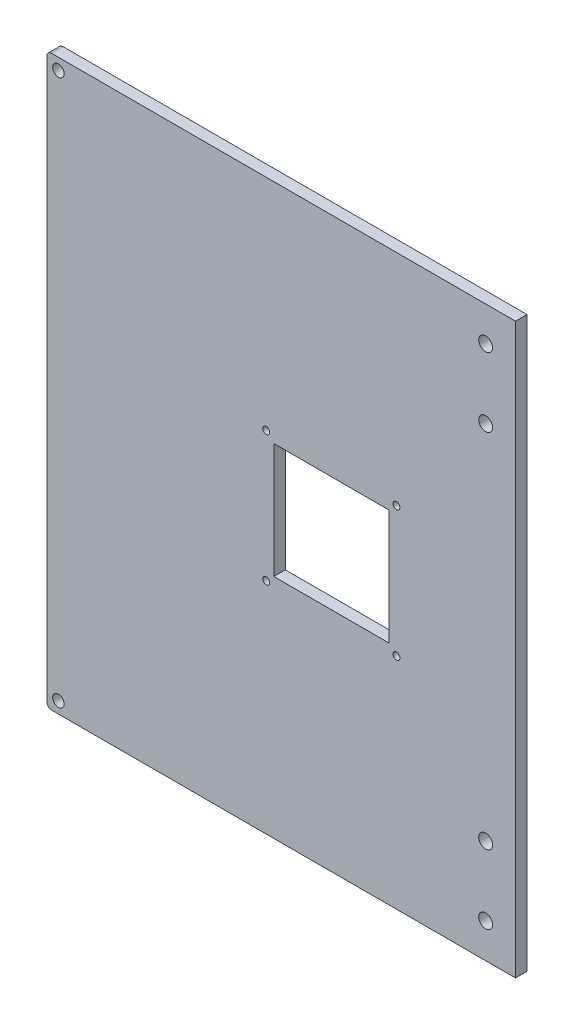
ISO-10303-21;
HEADER;
FILE_DESCRIPTION(('STEP AP214'),'2;1');
FILE_NAME('part.step','',(''),(''),'','','');
FILE_SCHEMA(('AUTOMOTIVE_DESIGN { 1 0 10303 214 1 1 1 1 }'));
ENDSEC;
DATA;
#1=APPLICATION_CONTEXT('core data for automotive mechanical design processes');
#2=APPLICATION_PROTOCOL_DEFINITION('international standard','automotive_design',2000,#1);
#3=PRODUCT_CONTEXT('',#1,'mechanical');
#4=PRODUCT('Part','Part','',(#3));
#5=PRODUCT_RELATED_PRODUCT_CATEGORY('part','',(#4));
#6=PRODUCT_DEFINITION_FORMATION('','',#4);
#7=PRODUCT_DEFINITION_CONTEXT('part definition',#1,'design');
#8=PRODUCT_DEFINITION('design','',#6,#7);
#9=PRODUCT_DEFINITION_SHAPE('','',#8);
#10=(LENGTH_UNIT() NAMED_UNIT(*) SI_UNIT(.MILLI.,.METRE.));
#11=(NAMED_UNIT(*) PLANE_ANGLE_UNIT() SI_UNIT($,.RADIAN.));
#12=(NAMED_UNIT(*) SI_UNIT($,.STERADIAN.) SOLID_ANGLE_UNIT());
#13=UNCERTAINTY_MEASURE_WITH_UNIT(LENGTH_MEASURE(1.E-05),#10,'distance_accuracy_value','');
#14=(GEOMETRIC_REPRESENTATION_CONTEXT(3) GLOBAL_UNCERTAINTY_ASSIGNED_CONTEXT((#13)) GLOBAL_UNIT_ASSIGNED_CONTEXT((#10,
#11,#12)) REPRESENTATION_CONTEXT('',''));
#15=CARTESIAN_POINT('',(0.,0.,0.));
#16=DIRECTION('',(0.,0.,1.));
#17=DIRECTION('',(1.,0.,0.));
#18=AXIS2_PLACEMENT_3D('',#15,#16,#17);
#19=CARTESIAN_POINT('',(-121.5,-121.5,5.));
#20=DIRECTION('',(0.,0.,1.));
#21=DIRECTION('',(1.,0.,0.));
#22=AXIS2_PLACEMENT_3D('',#19,#20,#21);
#23=PLANE('',#22);
#24=CARTESIAN_POINT('',(67.,108.5,5.));
#25=DIRECTION('',(0.,0.,1.));
#26=DIRECTION('',(1.,0.,0.));
#27=AXIS2_PLACEMENT_3D('',#24,#25,#26);
#28=CIRCLE('',#27,3.00000000000001);
#29=CARTESIAN_POINT('',(70.,108.5,5.));
#30=VERTEX_POINT('',#29);
#31=EDGE_CURVE('E127',#30,#30,#28,.T.);
#32=ORIENTED_EDGE('',*,*,#31,.F.);
#33=EDGE_LOOP('',(#32));
#34=FACE_BOUND('',#33,.T.);
#35=CARTESIAN_POINT('',(67.,-78.5,5.));
#36=DIRECTION('',(0.,0.,1.));
#37=DIRECTION('',(1.,0.,0.));
#38=AXIS2_PLACEMENT_3D('',#35,#36,#37);
#39=CIRCLE('',#38,3.00000000000001);
#40=CARTESIAN_POINT('',(70.,-78.5,5.));
#41=VERTEX_POINT('',#40);
#42=EDGE_CURVE('E282',#41,#41,#39,.T.);
#43=ORIENTED_EDGE('',*,*,#42,.F.);
#44=EDGE_LOOP('',(#43));
#45=FACE_BOUND('',#44,.T.);
#46=CARTESIAN_POINT('',(67.,-108.5,5.));
#47=DIRECTION('',(0.,0.,1.));
#48=DIRECTION('',(1.,0.,0.));
#49=AXIS2_PLACEMENT_3D('',#46,#47,#48);
#50=CIRCLE('',#49,3.00000000000001);
#51=CARTESIAN_POINT('',(70.,-108.5,5.));
#52=VERTEX_POINT('',#51);
#53=EDGE_CURVE('E285',#52,#52,#50,.T.);
#54=ORIENTED_EDGE('',*,*,#53,.F.);
#55=EDGE_LOOP('',(#54));
#56=FACE_BOUND('',#55,.T.);
#57=CARTESIAN_POINT('',(67.,78.5,5.));
#58=DIRECTION('',(0.,0.,1.));
#59=DIRECTION('',(1.,0.,0.));
#60=AXIS2_PLACEMENT_3D('',#57,#58,#59);
#61=CIRCLE('',#60,3.00000000000001);
#62=CARTESIAN_POINT('',(70.,78.5,5.));
#63=VERTEX_POINT('',#62);
#64=EDGE_CURVE('E288',#63,#63,#61,.T.);
#65=ORIENTED_EDGE('',*,*,#64,.F.);
#66=EDGE_LOOP('',(#65));
#67=FACE_BOUND('',#66,.T.);
#68=DIRECTION('',(0.,-1.,0.));
#69=VECTOR('',#68,1.);
#70=CARTESIAN_POINT('',(80.,-121.5,5.));
#71=LINE('',#70,#69);
#72=CARTESIAN_POINT('',(80.,123.5,5.));
#73=VERTEX_POINT('',#72);
#74=CARTESIAN_POINT('',(80.,-123.5,5.));
#75=VERTEX_POINT('',#74);
#76=EDGE_CURVE('E112',#73,#75,#71,.T.);
#77=ORIENTED_EDGE('',*,*,#76,.F.);
#78=DIRECTION('',(-1.,0.,0.));
#79=VECTOR('',#78,1.);
#80=CARTESIAN_POINT('',(121.5,123.5,5.));
#81=LINE('',#80,#79);
#82=CARTESIAN_POINT('',(-121.5,123.5,5.));
#83=VERTEX_POINT('',#82);
#84=EDGE_CURVE('E172',#73,#83,#81,.T.);
#85=ORIENTED_EDGE('',*,*,#84,.T.);
#86=CARTESIAN_POINT('',(-121.5,121.5,5.));
#87=DIRECTION('',(0.,0.,1.));
#88=DIRECTION('',(-1.,0.,0.));
#89=AXIS2_PLACEMENT_3D('',#86,#87,#88);
#90=CIRCLE('',#89,2.);
#91=CARTESIAN_POINT('',(-123.5,121.5,5.));
#92=VERTEX_POINT('',#91);
#93=EDGE_CURVE('E158',#83,#92,#90,.T.);
#94=ORIENTED_EDGE('',*,*,#93,.T.);
#95=DIRECTION('',(0.,-1.,0.));
#96=VECTOR('',#95,1.);
#97=CARTESIAN_POINT('',(-123.5,121.5,5.));
#98=LINE('',#97,#96);
#99=CARTESIAN_POINT('',(-123.5,-121.5,5.));
#100=VERTEX_POINT('',#99);
#101=EDGE_CURVE('E148',#92,#100,#98,.T.);
#102=ORIENTED_EDGE('',*,*,#101,.T.);
#103=CARTESIAN_POINT('',(-121.5,-121.5,5.));
#104=DIRECTION('',(0.,0.,1.));
#105=DIRECTION('',(1.,0.,0.));
#106=AXIS2_PLACEMENT_3D('',#103,#104,#105);
#107=CIRCLE('',#106,2.);
#108=CARTESIAN_POINT('',(-121.5,-123.5,5.));
#109=VERTEX_POINT('',#108);
#110=EDGE_CURVE('E143',#100,#109,#107,.T.);
#111=ORIENTED_EDGE('',*,*,#110,.T.);
#112=DIRECTION('',(1.,0.,0.));
#113=VECTOR('',#112,1.);
#114=CARTESIAN_POINT('',(-121.5,-123.5,5.));
#115=LINE('',#114,#113);
#116=EDGE_CURVE('E170',#109,#75,#115,.T.);
#117=ORIENTED_EDGE('',*,*,#116,.T.);
#118=EDGE_LOOP('',(#77,#85,#94,#102,#111,#117));
#119=FACE_BOUND('',#118,.T.);
#120=CARTESIAN_POINT('',(28.2842712474618,28.284271247462,5.));
#121=DIRECTION('',(0.,0.,-1.));
#122=DIRECTION('',(1.,0.,0.));
#123=AXIS2_PLACEMENT_3D('',#120,#121,#122);
#124=CIRCLE('',#123,1.5);
#125=CARTESIAN_POINT('',(29.7842712474619,28.284271247462,5.));
#126=VERTEX_POINT('',#125);
#127=EDGE_CURVE('E259',#126,#126,#124,.T.);
#128=ORIENTED_EDGE('',*,*,#127,.T.);
#129=EDGE_LOOP('',(#128));
#130=FACE_BOUND('',#129,.T.);
#131=CARTESIAN_POINT('',(28.2842712474618,-28.284271247462,5.));
#132=DIRECTION('',(0.,0.,-1.));
#133=DIRECTION('',(-1.,0.,0.));
#134=AXIS2_PLACEMENT_3D('',#131,#132,#133);
#135=CIRCLE('',#134,1.5);
#136=CARTESIAN_POINT('',(26.7842712474618,-28.284271247462,5.));
#137=VERTEX_POINT('',#136);
#138=EDGE_CURVE('E265',#137,#137,#135,.T.);
#139=ORIENTED_EDGE('',*,*,#138,.T.);
#140=EDGE_LOOP('',(#139));
#141=FACE_BOUND('',#140,.T.);
#142=CARTESIAN_POINT('',(-28.2842712474618,-28.284271247462,5.));
#143=DIRECTION('',(0.,0.,-1.));
#144=DIRECTION('',(1.,0.,0.));
#145=AXIS2_PLACEMENT_3D('',#142,#143,#144);
#146=CIRCLE('',#145,1.5);
#147=CARTESIAN_POINT('',(-26.7842712474618,-28.284271247462,5.));
#148=VERTEX_POINT('',#147);
#149=EDGE_CURVE('E271',#148,#148,#146,.T.);
#150=ORIENTED_EDGE('',*,*,#149,.T.);
#151=EDGE_LOOP('',(#150));
#152=FACE_BOUND('',#151,.T.);
#153=CARTESIAN_POINT('',(-28.2842712474618,28.284271247462,5.));
#154=DIRECTION('',(0.,0.,-1.));
#155=DIRECTION('',(-1.,0.,0.));
#156=AXIS2_PLACEMENT_3D('',#153,#154,#155);
#157=CIRCLE('',#156,1.5);
#158=CARTESIAN_POINT('',(-29.7842712474619,28.284271247462,5.));
#159=VERTEX_POINT('',#158);
#160=EDGE_CURVE('E248',#159,#159,#157,.T.);
#161=ORIENTED_EDGE('',*,*,#160,.T.);
#162=EDGE_LOOP('',(#161));
#163=FACE_BOUND('',#162,.T.);
#164=DIRECTION('',(1.,0.,0.));
#165=VECTOR('',#164,1.);
#166=CARTESIAN_POINT('',(-25.,25.,5.));
#167=LINE('',#166,#165);
#168=CARTESIAN_POINT('',(-25.,25.,5.));
#169=VERTEX_POINT('',#168);
#170=CARTESIAN_POINT('',(25.,25.,5.));
#171=VERTEX_POINT('',#170);
#172=EDGE_CURVE('E239',#169,#171,#167,.T.);
#173=ORIENTED_EDGE('',*,*,#172,.T.);
#174=DIRECTION('',(0.,-1.,0.));
#175=VECTOR('',#174,1.);
#176=CARTESIAN_POINT('',(25.,25.,5.));
#177=LINE('',#176,#175);
#178=CARTESIAN_POINT('',(25.,-25.,5.));
#179=VERTEX_POINT('',#178);
#180=EDGE_CURVE('E252',#171,#179,#177,.T.);
#181=ORIENTED_EDGE('',*,*,#180,.T.);
#182=DIRECTION('',(-1.,0.,0.));
#183=VECTOR('',#182,1.);
#184=CARTESIAN_POINT('',(25.,-25.,5.));
#185=LINE('',#184,#183);
#186=CARTESIAN_POINT('',(-25.,-25.,5.));
#187=VERTEX_POINT('',#186);
#188=EDGE_CURVE('E57',#179,#187,#185,.T.);
#189=ORIENTED_EDGE('',*,*,#188,.T.);
#190=DIRECTION('',(0.,1.,0.));
#191=VECTOR('',#190,1.);
#192=CARTESIAN_POINT('',(-25.,-25.,5.));
#193=LINE('',#192,#191);
#194=EDGE_CURVE('E231',#187,#169,#193,.T.);
#195=ORIENTED_EDGE('',*,*,#194,.T.);
#196=EDGE_LOOP('',(#173,#181,#189,#195));
#197=FACE_BOUND('',#196,.T.);
#198=CARTESIAN_POINT('',(-118.5,118.5,5.));
#199=DIRECTION('',(0.,0.,1.));
#200=DIRECTION('',(1.,0.,0.));
#201=AXIS2_PLACEMENT_3D('',#198,#199,#200);
#202=CIRCLE('',#201,2.5);
#203=CARTESIAN_POINT('',(-116.,118.5,5.));
#204=VERTEX_POINT('',#203);
#205=EDGE_CURVE('E136',#204,#204,#202,.T.);
#206=ORIENTED_EDGE('',*,*,#205,.F.);
#207=EDGE_LOOP('',(#206));
#208=FACE_BOUND('',#207,.T.);
#209=CARTESIAN_POINT('',(-118.5,-118.5,5.));
#210=DIRECTION('',(0.,0.,1.));
#211=DIRECTION('',(-1.,0.,0.));
#212=AXIS2_PLACEMENT_3D('',#209,#210,#211);
#213=CIRCLE('',#212,2.5);
#214=CARTESIAN_POINT('',(-121.,-118.5,5.));
#215=VERTEX_POINT('',#214);
#216=EDGE_CURVE('E218',#215,#215,#213,.T.);
#217=ORIENTED_EDGE('',*,*,#216,.F.);
#218=EDGE_LOOP('',(#217));
#219=FACE_BOUND('',#218,.T.);
#220=ADVANCED_FACE('F35',(#34,#45,#56,#67,#119,#130,#141,#152,#163,#197,#208,#219),#23,.T.);
#221=CARTESIAN_POINT('',(-121.5,-121.5,0.));
#222=DIRECTION('',(0.,0.,1.));
#223=DIRECTION('',(1.,0.,0.));
#224=AXIS2_PLACEMENT_3D('',#221,#222,#223);
#225=PLANE('',#224);
#226=CARTESIAN_POINT('',(67.,108.5,0.));
#227=DIRECTION('',(0.,0.,-1.));
#228=DIRECTION('',(-1.,0.,0.));
#229=AXIS2_PLACEMENT_3D('',#226,#227,#228);
#230=CIRCLE('',#229,3.00000000000001);
#231=CARTESIAN_POINT('',(64.,108.5,0.));
#232=VERTEX_POINT('',#231);
#233=EDGE_CURVE('E291',#232,#232,#230,.T.);
#234=ORIENTED_EDGE('',*,*,#233,.F.);
#235=EDGE_LOOP('',(#234));
#236=FACE_BOUND('',#235,.T.);
#237=CARTESIAN_POINT('',(67.,-78.5,0.));
#238=DIRECTION('',(0.,0.,-1.));
#239=DIRECTION('',(1.,0.,0.));
#240=AXIS2_PLACEMENT_3D('',#237,#238,#239);
#241=CIRCLE('',#240,3.00000000000001);
#242=CARTESIAN_POINT('',(70.,-78.5,0.));
#243=VERTEX_POINT('',#242);
#244=EDGE_CURVE('E296',#243,#243,#241,.T.);
#245=ORIENTED_EDGE('',*,*,#244,.F.);
#246=EDGE_LOOP('',(#245));
#247=FACE_BOUND('',#246,.T.);
#248=CARTESIAN_POINT('',(67.,-108.5,0.));
#249=DIRECTION('',(0.,0.,-1.));
#250=DIRECTION('',(1.,0.,0.));
#251=AXIS2_PLACEMENT_3D('',#248,#249,#250);
#252=CIRCLE('',#251,3.00000000000001);
#253=CARTESIAN_POINT('',(70.,-108.5,0.));
#254=VERTEX_POINT('',#253);
#255=EDGE_CURVE('E292',#254,#254,#252,.T.);
#256=ORIENTED_EDGE('',*,*,#255,.F.);
#257=EDGE_LOOP('',(#256));
#258=FACE_BOUND('',#257,.T.);
#259=CARTESIAN_POINT('',(67.,78.5,0.));
#260=DIRECTION('',(0.,0.,-1.));
#261=DIRECTION('',(-1.,0.,0.));
#262=AXIS2_PLACEMENT_3D('',#259,#260,#261);
#263=CIRCLE('',#262,3.00000000000001);
#264=CARTESIAN_POINT('',(64.,78.5,0.));
#265=VERTEX_POINT('',#264);
#266=EDGE_CURVE('E295',#265,#265,#263,.T.);
#267=ORIENTED_EDGE('',*,*,#266,.F.);
#268=EDGE_LOOP('',(#267));
#269=FACE_BOUND('',#268,.T.);
#270=CARTESIAN_POINT('',(28.2842712474618,28.284271247462,0.));
#271=DIRECTION('',(0.,0.,-1.));
#272=DIRECTION('',(1.,0.,0.));
#273=AXIS2_PLACEMENT_3D('',#270,#271,#272);
#274=CIRCLE('',#273,1.5);
#275=CARTESIAN_POINT('',(29.7842712474619,28.284271247462,0.));
#276=VERTEX_POINT('',#275);
#277=EDGE_CURVE('E116',#276,#276,#274,.T.);
#278=ORIENTED_EDGE('',*,*,#277,.F.);
#279=EDGE_LOOP('',(#278));
#280=FACE_BOUND('',#279,.T.);
#281=CARTESIAN_POINT('',(28.2842712474618,-28.284271247462,0.));
#282=DIRECTION('',(0.,0.,-1.));
#283=DIRECTION('',(-1.,0.,0.));
#284=AXIS2_PLACEMENT_3D('',#281,#282,#283);
#285=CIRCLE('',#284,1.5);
#286=CARTESIAN_POINT('',(26.7842712474618,-28.284271247462,0.));
#287=VERTEX_POINT('',#286);
#288=EDGE_CURVE('E262',#287,#287,#285,.T.);
#289=ORIENTED_EDGE('',*,*,#288,.F.);
#290=EDGE_LOOP('',(#289));
#291=FACE_BOUND('',#290,.T.);
#292=CARTESIAN_POINT('',(-28.2842712474618,-28.284271247462,0.));
#293=DIRECTION('',(0.,0.,-1.));
#294=DIRECTION('',(1.,0.,0.));
#295=AXIS2_PLACEMENT_3D('',#292,#293,#294);
#296=CIRCLE('',#295,1.5);
#297=CARTESIAN_POINT('',(-26.7842712474618,-28.284271247462,0.));
#298=VERTEX_POINT('',#297);
#299=EDGE_CURVE('E268',#298,#298,#296,.T.);
#300=ORIENTED_EDGE('',*,*,#299,.F.);
#301=EDGE_LOOP('',(#300));
#302=FACE_BOUND('',#301,.T.);
#303=CARTESIAN_POINT('',(-28.2842712474618,28.284271247462,0.));
#304=DIRECTION('',(0.,0.,-1.));
#305=DIRECTION('',(-1.,0.,0.));
#306=AXIS2_PLACEMENT_3D('',#303,#304,#305);
#307=CIRCLE('',#306,1.5);
#308=CARTESIAN_POINT('',(-29.7842712474619,28.284271247462,0.));
#309=VERTEX_POINT('',#308);
#310=EDGE_CURVE('E274',#309,#309,#307,.T.);
#311=ORIENTED_EDGE('',*,*,#310,.F.);
#312=EDGE_LOOP('',(#311));
#313=FACE_BOUND('',#312,.T.);
#314=DIRECTION('',(0.,-1.,0.));
#315=VECTOR('',#314,1.);
#316=CARTESIAN_POINT('',(25.,25.,0.));
#317=LINE('',#316,#315);
#318=CARTESIAN_POINT('',(25.,25.,0.));
#319=VERTEX_POINT('',#318);
#320=CARTESIAN_POINT('',(25.,-25.,0.));
#321=VERTEX_POINT('',#320);
#322=EDGE_CURVE('E243',#319,#321,#317,.T.);
#323=ORIENTED_EDGE('',*,*,#322,.F.);
#324=DIRECTION('',(1.,0.,0.));
#325=VECTOR('',#324,1.);
#326=CARTESIAN_POINT('',(-25.,25.,0.));
#327=LINE('',#326,#325);
#328=CARTESIAN_POINT('',(-25.,25.,0.));
#329=VERTEX_POINT('',#328);
#330=EDGE_CURVE('E246',#329,#319,#327,.T.);
#331=ORIENTED_EDGE('',*,*,#330,.F.);
#332=DIRECTION('',(0.,1.,0.));
#333=VECTOR('',#332,1.);
#334=CARTESIAN_POINT('',(-25.,-25.,0.));
#335=LINE('',#334,#333);
#336=CARTESIAN_POINT('',(-25.,-25.,0.));
#337=VERTEX_POINT('',#336);
#338=EDGE_CURVE('E236',#337,#329,#335,.T.);
#339=ORIENTED_EDGE('',*,*,#338,.F.);
#340=DIRECTION('',(-1.,0.,0.));
#341=VECTOR('',#340,1.);
#342=CARTESIAN_POINT('',(25.,-25.,0.));
#343=LINE('',#342,#341);
#344=EDGE_CURVE('E240',#321,#337,#343,.T.);
#345=ORIENTED_EDGE('',*,*,#344,.F.);
#346=EDGE_LOOP('',(#323,#331,#339,#345));
#347=FACE_BOUND('',#346,.T.);
#348=DIRECTION('',(-1.,0.,0.));
#349=VECTOR('',#348,1.);
#350=CARTESIAN_POINT('',(121.5,123.5,0.));
#351=LINE('',#350,#349);
#352=CARTESIAN_POINT('',(80.,123.5,0.));
#353=VERTEX_POINT('',#352);
#354=CARTESIAN_POINT('',(-121.5,123.5,0.));
#355=VERTEX_POINT('',#354);
#356=EDGE_CURVE('E126',#353,#355,#351,.T.);
#357=ORIENTED_EDGE('',*,*,#356,.F.);
#358=DIRECTION('',(0.,1.,0.));
#359=VECTOR('',#358,1.);
#360=CARTESIAN_POINT('',(80.,-150.,0.));
#361=LINE('',#360,#359);
#362=CARTESIAN_POINT('',(80.,-123.5,0.));
#363=VERTEX_POINT('',#362);
#364=EDGE_CURVE('E50',#363,#353,#361,.T.);
#365=ORIENTED_EDGE('',*,*,#364,.F.);
#366=DIRECTION('',(1.,0.,0.));
#367=VECTOR('',#366,1.);
#368=CARTESIAN_POINT('',(-121.5,-123.5,0.));
#369=LINE('',#368,#367);
#370=CARTESIAN_POINT('',(-121.5,-123.5,0.));
#371=VERTEX_POINT('',#370);
#372=EDGE_CURVE('E123',#371,#363,#369,.T.);
#373=ORIENTED_EDGE('',*,*,#372,.F.);
#374=CARTESIAN_POINT('',(-121.5,-121.5,0.));
#375=DIRECTION('',(0.,0.,1.));
#376=DIRECTION('',(1.,0.,0.));
#377=AXIS2_PLACEMENT_3D('',#374,#375,#376);
#378=CIRCLE('',#377,2.);
#379=CARTESIAN_POINT('',(-123.5,-121.5,0.));
#380=VERTEX_POINT('',#379);
#381=EDGE_CURVE('E132',#380,#371,#378,.T.);
#382=ORIENTED_EDGE('',*,*,#381,.F.);
#383=DIRECTION('',(0.,-1.,0.));
#384=VECTOR('',#383,1.);
#385=CARTESIAN_POINT('',(-123.5,121.5,0.));
#386=LINE('',#385,#384);
#387=CARTESIAN_POINT('',(-123.5,121.5,0.));
#388=VERTEX_POINT('',#387);
#389=EDGE_CURVE('E141',#388,#380,#386,.T.);
#390=ORIENTED_EDGE('',*,*,#389,.F.);
#391=CARTESIAN_POINT('',(-121.5,121.5,0.));
#392=DIRECTION('',(0.,0.,1.));
#393=DIRECTION('',(-1.,0.,0.));
#394=AXIS2_PLACEMENT_3D('',#391,#392,#393);
#395=CIRCLE('',#394,2.);
#396=EDGE_CURVE('E134',#355,#388,#395,.T.);
#397=ORIENTED_EDGE('',*,*,#396,.F.);
#398=EDGE_LOOP('',(#357,#365,#373,#382,#390,#397));
#399=FACE_BOUND('',#398,.T.);
#400=CARTESIAN_POINT('',(-118.5,118.5,0.));
#401=DIRECTION('',(0.,0.,1.));
#402=DIRECTION('',(1.,0.,0.));
#403=AXIS2_PLACEMENT_3D('',#400,#401,#402);
#404=CIRCLE('',#403,2.5);
#405=CARTESIAN_POINT('',(-116.,118.5,0.));
#406=VERTEX_POINT('',#405);
#407=EDGE_CURVE('E175',#406,#406,#404,.T.);
#408=ORIENTED_EDGE('',*,*,#407,.T.);
#409=EDGE_LOOP('',(#408));
#410=FACE_BOUND('',#409,.T.);
#411=CARTESIAN_POINT('',(-118.5,-118.5,0.));
#412=DIRECTION('',(0.,0.,1.));
#413=DIRECTION('',(-1.,0.,0.));
#414=AXIS2_PLACEMENT_3D('',#411,#412,#413);
#415=CIRCLE('',#414,2.5);
#416=CARTESIAN_POINT('',(-121.,-118.5,0.));
#417=VERTEX_POINT('',#416);
#418=EDGE_CURVE('E220',#417,#417,#415,.T.);
#419=ORIENTED_EDGE('',*,*,#418,.T.);
#420=EDGE_LOOP('',(#419));
#421=FACE_BOUND('',#420,.T.);
#422=ADVANCED_FACE('F120',(#236,#247,#258,#269,#280,#291,#302,#313,#347,#399,#410,#421),#225,.F.);
#423=CARTESIAN_POINT('',(-121.5,-121.5,5.));
#424=DIRECTION('',(0.,0.,-1.));
#425=DIRECTION('',(-1.,0.,0.));
#426=AXIS2_PLACEMENT_3D('',#423,#424,#425);
#427=CYLINDRICAL_SURFACE('',#426,2.);
#428=ORIENTED_EDGE('',*,*,#381,.T.);
#429=DIRECTION('',(0.,0.,-1.));
#430=VECTOR('',#429,1.);
#431=CARTESIAN_POINT('',(-121.5,-123.5,5.));
#432=LINE('',#431,#430);
#433=EDGE_CURVE('E43',#109,#371,#432,.T.);
#434=ORIENTED_EDGE('',*,*,#433,.F.);
#435=ORIENTED_EDGE('',*,*,#110,.F.);
#436=DIRECTION('',(0.,0.,-1.));
#437=VECTOR('',#436,1.);
#438=CARTESIAN_POINT('',(-123.5,-121.5,5.));
#439=LINE('',#438,#437);
#440=EDGE_CURVE('E144',#100,#380,#439,.T.);
#441=ORIENTED_EDGE('',*,*,#440,.T.);
#442=EDGE_LOOP('',(#428,#434,#435,#441));
#443=FACE_BOUND('',#442,.T.);
#444=ADVANCED_FACE('F37',(#443),#427,.T.);
#445=CARTESIAN_POINT('',(-121.5,-123.5,5.));
#446=DIRECTION('',(0.,1.,0.));
#447=DIRECTION('',(-1.,0.,0.));
#448=AXIS2_PLACEMENT_3D('',#445,#446,#447);
#449=PLANE('',#448);
#450=ORIENTED_EDGE('',*,*,#372,.T.);
#451=DIRECTION('',(0.,0.,1.));
#452=VECTOR('',#451,1.);
#453=CARTESIAN_POINT('',(80.,-123.5,5.));
#454=LINE('',#453,#452);
#455=EDGE_CURVE('E109',#363,#75,#454,.T.);
#456=ORIENTED_EDGE('',*,*,#455,.T.);
#457=ORIENTED_EDGE('',*,*,#116,.F.);
#458=ORIENTED_EDGE('',*,*,#433,.T.);
#459=EDGE_LOOP('',(#450,#456,#457,#458));
#460=FACE_BOUND('',#459,.T.);
#461=ADVANCED_FACE('F129',(#460),#449,.F.);
#462=CARTESIAN_POINT('',(121.5,123.5,5.));
#463=DIRECTION('',(0.,-1.,0.));
#464=DIRECTION('',(1.,0.,0.));
#465=AXIS2_PLACEMENT_3D('',#462,#463,#464);
#466=PLANE('',#465);
#467=ORIENTED_EDGE('',*,*,#84,.F.);
#468=DIRECTION('',(0.,0.,-1.));
#469=VECTOR('',#468,1.);
#470=CARTESIAN_POINT('',(80.,123.5,5.));
#471=LINE('',#470,#469);
#472=EDGE_CURVE('E11',#73,#353,#471,.T.);
#473=ORIENTED_EDGE('',*,*,#472,.T.);
#474=ORIENTED_EDGE('',*,*,#356,.T.);
#475=DIRECTION('',(0.,0.,-1.));
#476=VECTOR('',#475,1.);
#477=CARTESIAN_POINT('',(-121.5,123.5,5.));
#478=LINE('',#477,#476);
#479=EDGE_CURVE('E151',#83,#355,#478,.T.);
#480=ORIENTED_EDGE('',*,*,#479,.F.);
#481=EDGE_LOOP('',(#467,#473,#474,#480));
#482=FACE_BOUND('',#481,.T.);
#483=ADVANCED_FACE('F180',(#482),#466,.F.);
#484=CARTESIAN_POINT('',(-121.5,121.5,5.));
#485=DIRECTION('',(0.,0.,-1.));
#486=DIRECTION('',(-1.,0.,0.));
#487=AXIS2_PLACEMENT_3D('',#484,#485,#486);
#488=CYLINDRICAL_SURFACE('',#487,2.);
#489=ORIENTED_EDGE('',*,*,#396,.T.);
#490=DIRECTION('',(0.,0.,-1.));
#491=VECTOR('',#490,1.);
#492=CARTESIAN_POINT('',(-123.5,121.5,5.));
#493=LINE('',#492,#491);
#494=EDGE_CURVE('E147',#92,#388,#493,.T.);
#495=ORIENTED_EDGE('',*,*,#494,.F.);
#496=ORIENTED_EDGE('',*,*,#93,.F.);
#497=ORIENTED_EDGE('',*,*,#479,.T.);
#498=EDGE_LOOP('',(#489,#495,#496,#497));
#499=FACE_BOUND('',#498,.T.);
#500=ADVANCED_FACE('F156',(#499),#488,.T.);
#501=CARTESIAN_POINT('',(-123.5,121.5,5.));
#502=DIRECTION('',(1.,0.,0.));
#503=DIRECTION('',(0.,1.,0.));
#504=AXIS2_PLACEMENT_3D('',#501,#502,#503);
#505=PLANE('',#504);
#506=ORIENTED_EDGE('',*,*,#389,.T.);
#507=ORIENTED_EDGE('',*,*,#440,.F.);
#508=ORIENTED_EDGE('',*,*,#101,.F.);
#509=ORIENTED_EDGE('',*,*,#494,.T.);
#510=EDGE_LOOP('',(#506,#507,#508,#509));
#511=FACE_BOUND('',#510,.T.);
#512=ADVANCED_FACE('F164',(#511),#505,.F.);
#513=CARTESIAN_POINT('',(-118.5,118.5,5.));
#514=DIRECTION('',(0.,0.,-1.));
#515=DIRECTION('',(-1.,0.,0.));
#516=AXIS2_PLACEMENT_3D('',#513,#514,#515);
#517=CYLINDRICAL_SURFACE('',#516,2.5);
#518=ORIENTED_EDGE('',*,*,#205,.T.);
#519=EDGE_LOOP('',(#518));
#520=FACE_BOUND('',#519,.T.);
#521=ORIENTED_EDGE('',*,*,#407,.F.);
#522=EDGE_LOOP('',(#521));
#523=FACE_BOUND('',#522,.T.);
#524=ADVANCED_FACE('F199',(#520,#523),#517,.F.);
#525=CARTESIAN_POINT('',(-118.5,-118.5,5.));
#526=DIRECTION('',(0.,0.,-1.));
#527=DIRECTION('',(-1.,0.,0.));
#528=AXIS2_PLACEMENT_3D('',#525,#526,#527);
#529=CYLINDRICAL_SURFACE('',#528,2.5);
#530=ORIENTED_EDGE('',*,*,#216,.T.);
#531=EDGE_LOOP('',(#530));
#532=FACE_BOUND('',#531,.T.);
#533=ORIENTED_EDGE('',*,*,#418,.F.);
#534=EDGE_LOOP('',(#533));
#535=FACE_BOUND('',#534,.T.);
#536=ADVANCED_FACE('F206',(#532,#535),#529,.F.);
#537=CARTESIAN_POINT('',(-25.,25.,5.));
#538=DIRECTION('',(0.,1.,0.));
#539=DIRECTION('',(-1.,0.,0.));
#540=AXIS2_PLACEMENT_3D('',#537,#538,#539);
#541=PLANE('',#540);
#542=ORIENTED_EDGE('',*,*,#330,.T.);
#543=DIRECTION('',(0.,0.,-1.));
#544=VECTOR('',#543,1.);
#545=CARTESIAN_POINT('',(25.,25.,5.));
#546=LINE('',#545,#544);
#547=EDGE_CURVE('E227',#171,#319,#546,.T.);
#548=ORIENTED_EDGE('',*,*,#547,.F.);
#549=ORIENTED_EDGE('',*,*,#172,.F.);
#550=DIRECTION('',(0.,0.,-1.));
#551=VECTOR('',#550,1.);
#552=CARTESIAN_POINT('',(-25.,25.,5.));
#553=LINE('',#552,#551);
#554=EDGE_CURVE('E224',#169,#329,#553,.T.);
#555=ORIENTED_EDGE('',*,*,#554,.T.);
#556=EDGE_LOOP('',(#542,#548,#549,#555));
#557=FACE_BOUND('',#556,.T.);
#558=ADVANCED_FACE('F211',(#557),#541,.F.);
#559=CARTESIAN_POINT('',(-25.,-25.,5.));
#560=DIRECTION('',(-1.,0.,0.));
#561=DIRECTION('',(0.,0.,1.));
#562=AXIS2_PLACEMENT_3D('',#559,#560,#561);
#563=PLANE('',#562);
#564=ORIENTED_EDGE('',*,*,#338,.T.);
#565=ORIENTED_EDGE('',*,*,#554,.F.);
#566=ORIENTED_EDGE('',*,*,#194,.F.);
#567=DIRECTION('',(0.,0.,-1.));
#568=VECTOR('',#567,1.);
#569=CARTESIAN_POINT('',(-25.,-25.,5.));
#570=LINE('',#569,#568);
#571=EDGE_CURVE('E233',#187,#337,#570,.T.);
#572=ORIENTED_EDGE('',*,*,#571,.T.);
#573=EDGE_LOOP('',(#564,#565,#566,#572));
#574=FACE_BOUND('',#573,.T.);
#575=ADVANCED_FACE('F331',(#574),#563,.F.);
#576=CARTESIAN_POINT('',(25.,-25.,5.));
#577=DIRECTION('',(0.,-1.,0.));
#578=DIRECTION('',(0.,0.,-1.));
#579=AXIS2_PLACEMENT_3D('',#576,#577,#578);
#580=PLANE('',#579);
#581=ORIENTED_EDGE('',*,*,#344,.T.);
#582=ORIENTED_EDGE('',*,*,#571,.F.);
#583=ORIENTED_EDGE('',*,*,#188,.F.);
#584=DIRECTION('',(0.,0.,-1.));
#585=VECTOR('',#584,1.);
#586=CARTESIAN_POINT('',(25.,-25.,5.));
#587=LINE('',#586,#585);
#588=EDGE_CURVE('E230',#179,#321,#587,.T.);
#589=ORIENTED_EDGE('',*,*,#588,.T.);
#590=EDGE_LOOP('',(#581,#582,#583,#589));
#591=FACE_BOUND('',#590,.T.);
#592=ADVANCED_FACE('F332',(#591),#580,.F.);
#593=CARTESIAN_POINT('',(25.,25.,5.));
#594=DIRECTION('',(1.,0.,0.));
#595=DIRECTION('',(0.,1.,0.));
#596=AXIS2_PLACEMENT_3D('',#593,#594,#595);
#597=PLANE('',#596);
#598=ORIENTED_EDGE('',*,*,#322,.T.);
#599=ORIENTED_EDGE('',*,*,#588,.F.);
#600=ORIENTED_EDGE('',*,*,#180,.F.);
#601=ORIENTED_EDGE('',*,*,#547,.T.);
#602=EDGE_LOOP('',(#598,#599,#600,#601));
#603=FACE_BOUND('',#602,.T.);
#604=ADVANCED_FACE('F325',(#603),#597,.F.);
#605=CARTESIAN_POINT('',(-28.2842712474618,28.284271247462,5.));
#606=DIRECTION('',(0.,0.,-1.));
#607=DIRECTION('',(-1.,0.,0.));
#608=AXIS2_PLACEMENT_3D('',#605,#606,#607);
#609=CYLINDRICAL_SURFACE('',#608,1.5);
#610=ORIENTED_EDGE('',*,*,#160,.F.);
#611=EDGE_LOOP('',(#610));
#612=FACE_BOUND('',#611,.T.);
#613=ORIENTED_EDGE('',*,*,#310,.T.);
#614=EDGE_LOOP('',(#613));
#615=FACE_BOUND('',#614,.T.);
#616=ADVANCED_FACE('F339',(#612,#615),#609,.F.);
#617=CARTESIAN_POINT('',(-28.2842712474618,-28.284271247462,5.));
#618=DIRECTION('',(0.,0.,-1.));
#619=DIRECTION('',(-1.,0.,0.));
#620=AXIS2_PLACEMENT_3D('',#617,#618,#619);
#621=CYLINDRICAL_SURFACE('',#620,1.5);
#622=ORIENTED_EDGE('',*,*,#149,.F.);
#623=EDGE_LOOP('',(#622));
#624=FACE_BOUND('',#623,.T.);
#625=ORIENTED_EDGE('',*,*,#299,.T.);
#626=EDGE_LOOP('',(#625));
#627=FACE_BOUND('',#626,.T.);
#628=ADVANCED_FACE('F372',(#624,#627),#621,.F.);
#629=CARTESIAN_POINT('',(28.2842712474618,-28.284271247462,5.));
#630=DIRECTION('',(0.,0.,-1.));
#631=DIRECTION('',(-1.,0.,0.));
#632=AXIS2_PLACEMENT_3D('',#629,#630,#631);
#633=CYLINDRICAL_SURFACE('',#632,1.5);
#634=ORIENTED_EDGE('',*,*,#138,.F.);
#635=EDGE_LOOP('',(#634));
#636=FACE_BOUND('',#635,.T.);
#637=ORIENTED_EDGE('',*,*,#288,.T.);
#638=EDGE_LOOP('',(#637));
#639=FACE_BOUND('',#638,.T.);
#640=ADVANCED_FACE('F382',(#636,#639),#633,.F.);
#641=CARTESIAN_POINT('',(28.2842712474618,28.284271247462,5.));
#642=DIRECTION('',(0.,0.,-1.));
#643=DIRECTION('',(-1.,0.,0.));
#644=AXIS2_PLACEMENT_3D('',#641,#642,#643);
#645=CYLINDRICAL_SURFACE('',#644,1.5);
#646=ORIENTED_EDGE('',*,*,#127,.F.);
#647=EDGE_LOOP('',(#646));
#648=FACE_BOUND('',#647,.T.);
#649=ORIENTED_EDGE('',*,*,#277,.T.);
#650=EDGE_LOOP('',(#649));
#651=FACE_BOUND('',#650,.T.);
#652=ADVANCED_FACE('F392',(#648,#651),#645,.F.);
#653=CARTESIAN_POINT('',(80.,-150.,10.));
#654=DIRECTION('',(-1.,0.,0.));
#655=DIRECTION('',(0.,0.,1.));
#656=AXIS2_PLACEMENT_3D('',#653,#654,#655);
#657=PLANE('',#656);
#658=ORIENTED_EDGE('',*,*,#364,.T.);
#659=ORIENTED_EDGE('',*,*,#472,.F.);
#660=ORIENTED_EDGE('',*,*,#76,.T.);
#661=ORIENTED_EDGE('',*,*,#455,.F.);
#662=EDGE_LOOP('',(#658,#659,#660,#661));
#663=FACE_BOUND('',#662,.T.);
#664=ADVANCED_FACE('F110',(#663),#657,.F.);
#665=CARTESIAN_POINT('',(67.,78.5,10.));
#666=DIRECTION('',(0.,0.,-1.));
#667=DIRECTION('',(-1.,0.,0.));
#668=AXIS2_PLACEMENT_3D('',#665,#666,#667);
#669=CYLINDRICAL_SURFACE('',#668,3.00000000000001);
#670=ORIENTED_EDGE('',*,*,#64,.T.);
#671=EDGE_LOOP('',(#670));
#672=FACE_BOUND('',#671,.T.);
#673=ORIENTED_EDGE('',*,*,#266,.T.);
#674=EDGE_LOOP('',(#673));
#675=FACE_BOUND('',#674,.T.);
#676=ADVANCED_FACE('F422',(#672,#675),#669,.F.);
#677=CARTESIAN_POINT('',(67.,-108.5,10.));
#678=DIRECTION('',(0.,0.,-1.));
#679=DIRECTION('',(-1.,0.,0.));
#680=AXIS2_PLACEMENT_3D('',#677,#678,#679);
#681=CYLINDRICAL_SURFACE('',#680,3.00000000000001);
#682=ORIENTED_EDGE('',*,*,#53,.T.);
#683=EDGE_LOOP('',(#682));
#684=FACE_BOUND('',#683,.T.);
#685=ORIENTED_EDGE('',*,*,#255,.T.);
#686=EDGE_LOOP('',(#685));
#687=FACE_BOUND('',#686,.T.);
#688=ADVANCED_FACE('F442',(#684,#687),#681,.F.);
#689=CARTESIAN_POINT('',(67.,-78.5,10.));
#690=DIRECTION('',(0.,0.,-1.));
#691=DIRECTION('',(-1.,0.,0.));
#692=AXIS2_PLACEMENT_3D('',#689,#690,#691);
#693=CYLINDRICAL_SURFACE('',#692,3.00000000000001);
#694=ORIENTED_EDGE('',*,*,#42,.T.);
#695=EDGE_LOOP('',(#694));
#696=FACE_BOUND('',#695,.T.);
#697=ORIENTED_EDGE('',*,*,#244,.T.);
#698=EDGE_LOOP('',(#697));
#699=FACE_BOUND('',#698,.T.);
#700=ADVANCED_FACE('F452',(#696,#699),#693,.F.);
#701=CARTESIAN_POINT('',(67.,108.5,10.));
#702=DIRECTION('',(0.,0.,-1.));
#703=DIRECTION('',(-1.,0.,0.));
#704=AXIS2_PLACEMENT_3D('',#701,#702,#703);
#705=CYLINDRICAL_SURFACE('',#704,3.00000000000001);
#706=ORIENTED_EDGE('',*,*,#31,.T.);
#707=EDGE_LOOP('',(#706));
#708=FACE_BOUND('',#707,.T.);
#709=ORIENTED_EDGE('',*,*,#233,.T.);
#710=EDGE_LOOP('',(#709));
#711=FACE_BOUND('',#710,.T.);
#712=ADVANCED_FACE('F304',(#708,#711),#705,.F.);
#713=CLOSED_SHELL('',(#220,#422,#444,#461,#483,#500,#512,#524,#536,#558,#575,#592,#604,#616,
#628,#640,#652,#664,#676,#688,#700,#712));
#714=MANIFOLD_SOLID_BREP('B2',#713);
#715=ADVANCED_BREP_SHAPE_REPRESENTATION('',(#18,#714),#14);
#716=SHAPE_DEFINITION_REPRESENTATION(#9,#715);
ENDSEC;
END-ISO-10303-21;
